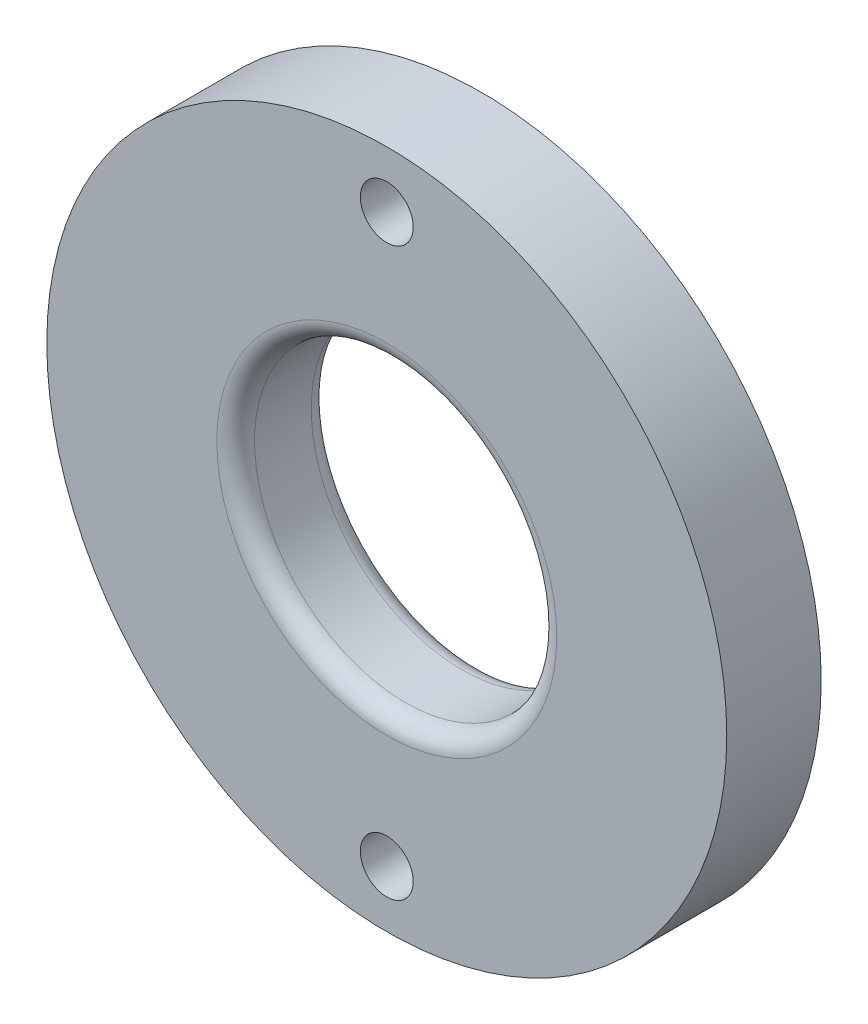
ISO-10303-21;
HEADER;
FILE_DESCRIPTION(('STEP AP214'),'2;1');
FILE_NAME('part.step','',(''),(''),'','','');
FILE_SCHEMA(('AUTOMOTIVE_DESIGN { 1 0 10303 214 1 1 1 1 }'));
ENDSEC;
DATA;
#1=APPLICATION_CONTEXT('core data for automotive mechanical design processes');
#2=APPLICATION_PROTOCOL_DEFINITION('international standard','automotive_design',2000,#1);
#3=PRODUCT_CONTEXT('',#1,'mechanical');
#4=PRODUCT('Part','Part','',(#3));
#5=PRODUCT_RELATED_PRODUCT_CATEGORY('part','',(#4));
#6=PRODUCT_DEFINITION_FORMATION('','',#4);
#7=PRODUCT_DEFINITION_CONTEXT('part definition',#1,'design');
#8=PRODUCT_DEFINITION('design','',#6,#7);
#9=PRODUCT_DEFINITION_SHAPE('','',#8);
#10=(LENGTH_UNIT() NAMED_UNIT(*) SI_UNIT(.MILLI.,.METRE.));
#11=(NAMED_UNIT(*) PLANE_ANGLE_UNIT() SI_UNIT($,.RADIAN.));
#12=(NAMED_UNIT(*) SI_UNIT($,.STERADIAN.) SOLID_ANGLE_UNIT());
#13=UNCERTAINTY_MEASURE_WITH_UNIT(LENGTH_MEASURE(1.E-05),#10,'distance_accuracy_value','');
#14=(GEOMETRIC_REPRESENTATION_CONTEXT(3) GLOBAL_UNCERTAINTY_ASSIGNED_CONTEXT((#13)) GLOBAL_UNIT_ASSIGNED_CONTEXT((#10,
#11,#12)) REPRESENTATION_CONTEXT('',''));
#15=CARTESIAN_POINT('',(0.,0.,0.));
#16=DIRECTION('',(0.,0.,1.));
#17=DIRECTION('',(1.,0.,0.));
#18=AXIS2_PLACEMENT_3D('',#15,#16,#17);
#19=CARTESIAN_POINT('',(0.,0.,3.175));
#20=DIRECTION('',(0.,0.,1.));
#21=DIRECTION('',(1.,0.,0.));
#22=AXIS2_PLACEMENT_3D('',#19,#20,#21);
#23=PLANE('',#22);
#24=CARTESIAN_POINT('',(0.,-9.525,3.175));
#25=DIRECTION('',(0.,0.,1.));
#26=DIRECTION('',(1.,0.,0.));
#27=AXIS2_PLACEMENT_3D('',#24,#25,#26);
#28=CIRCLE('',#27,0.889);
#29=CARTESIAN_POINT('',(0.889,-9.525,3.175));
#30=VERTEX_POINT('',#29);
#31=EDGE_CURVE('E68',#30,#30,#28,.T.);
#32=ORIENTED_EDGE('',*,*,#31,.F.);
#33=EDGE_LOOP('',(#32));
#34=FACE_BOUND('',#33,.T.);
#35=CARTESIAN_POINT('',(0.,9.525,3.175));
#36=DIRECTION('',(0.,0.,1.));
#37=DIRECTION('',(1.,0.,0.));
#38=AXIS2_PLACEMENT_3D('',#35,#36,#37);
#39=CIRCLE('',#38,0.889);
#40=CARTESIAN_POINT('',(0.889,9.525,3.175));
#41=VERTEX_POINT('',#40);
#42=EDGE_CURVE('E62',#41,#41,#39,.T.);
#43=ORIENTED_EDGE('',*,*,#42,.F.);
#44=EDGE_LOOP('',(#43));
#45=FACE_BOUND('',#44,.T.);
#46=CARTESIAN_POINT('',(0.,0.,3.175));
#47=DIRECTION('',(0.,0.,1.));
#48=DIRECTION('',(1.,0.,0.));
#49=AXIS2_PLACEMENT_3D('',#46,#47,#48);
#50=CIRCLE('',#49,5.715);
#51=CARTESIAN_POINT('',(5.715,0.,3.175));
#52=VERTEX_POINT('',#51);
#53=EDGE_CURVE('E10',#52,#52,#50,.F.);
#54=ORIENTED_EDGE('',*,*,#53,.T.);
#55=EDGE_LOOP('',(#54));
#56=FACE_BOUND('',#55,.T.);
#57=CARTESIAN_POINT('',(0.,0.,3.175));
#58=DIRECTION('',(0.,0.,1.));
#59=DIRECTION('',(1.,0.,0.));
#60=AXIS2_PLACEMENT_3D('',#57,#58,#59);
#61=CIRCLE('',#60,11.43);
#62=CARTESIAN_POINT('',(11.43,0.,3.175));
#63=VERTEX_POINT('',#62);
#64=EDGE_CURVE('E53',#63,#63,#61,.T.);
#65=ORIENTED_EDGE('',*,*,#64,.T.);
#66=EDGE_LOOP('',(#65));
#67=FACE_BOUND('',#66,.T.);
#68=ADVANCED_FACE('F33',(#34,#45,#56,#67),#23,.T.);
#69=CARTESIAN_POINT('',(0.,0.,0.));
#70=DIRECTION('',(0.,0.,1.));
#71=DIRECTION('',(1.,0.,0.));
#72=AXIS2_PLACEMENT_3D('',#69,#70,#71);
#73=PLANE('',#72);
#74=CARTESIAN_POINT('',(0.,-9.525,0.));
#75=DIRECTION('',(0.,0.,1.));
#76=DIRECTION('',(1.,0.,0.));
#77=AXIS2_PLACEMENT_3D('',#74,#75,#76);
#78=CIRCLE('',#77,0.888999999999999);
#79=CARTESIAN_POINT('',(0.888999999999999,-9.525,0.));
#80=VERTEX_POINT('',#79);
#81=EDGE_CURVE('E65',#80,#80,#78,.T.);
#82=ORIENTED_EDGE('',*,*,#81,.T.);
#83=EDGE_LOOP('',(#82));
#84=FACE_BOUND('',#83,.T.);
#85=CARTESIAN_POINT('',(0.,9.525,0.));
#86=DIRECTION('',(0.,0.,1.));
#87=DIRECTION('',(1.,0.,0.));
#88=AXIS2_PLACEMENT_3D('',#85,#86,#87);
#89=CIRCLE('',#88,0.888999999999999);
#90=CARTESIAN_POINT('',(0.888999999999999,9.525,0.));
#91=VERTEX_POINT('',#90);
#92=EDGE_CURVE('E57',#91,#91,#89,.T.);
#93=ORIENTED_EDGE('',*,*,#92,.T.);
#94=EDGE_LOOP('',(#93));
#95=FACE_BOUND('',#94,.T.);
#96=CARTESIAN_POINT('',(0.,0.,0.));
#97=DIRECTION('',(0.,0.,1.));
#98=DIRECTION('',(1.,0.,0.));
#99=AXIS2_PLACEMENT_3D('',#96,#97,#98);
#100=CIRCLE('',#99,5.715);
#101=CARTESIAN_POINT('',(5.715,0.,0.));
#102=VERTEX_POINT('',#101);
#103=EDGE_CURVE('E48',#102,#102,#100,.T.);
#104=ORIENTED_EDGE('',*,*,#103,.T.);
#105=EDGE_LOOP('',(#104));
#106=FACE_BOUND('',#105,.T.);
#107=CARTESIAN_POINT('',(0.,0.,0.));
#108=DIRECTION('',(0.,0.,1.));
#109=DIRECTION('',(1.,0.,0.));
#110=AXIS2_PLACEMENT_3D('',#107,#108,#109);
#111=CIRCLE('',#110,11.43);
#112=CARTESIAN_POINT('',(11.43,0.,0.));
#113=VERTEX_POINT('',#112);
#114=EDGE_CURVE('E54',#113,#113,#111,.T.);
#115=ORIENTED_EDGE('',*,*,#114,.F.);
#116=EDGE_LOOP('',(#115));
#117=FACE_BOUND('',#116,.T.);
#118=ADVANCED_FACE('F76',(#84,#95,#106,#117),#73,.F.);
#119=CARTESIAN_POINT('',(0.,0.,3.175));
#120=DIRECTION('',(0.,0.,-1.));
#121=DIRECTION('',(-1.,0.,0.));
#122=AXIS2_PLACEMENT_3D('',#119,#120,#121);
#123=CYLINDRICAL_SURFACE('',#122,11.43);
#124=ORIENTED_EDGE('',*,*,#64,.F.);
#125=EDGE_LOOP('',(#124));
#126=FACE_BOUND('',#125,.T.);
#127=ORIENTED_EDGE('',*,*,#114,.T.);
#128=EDGE_LOOP('',(#127));
#129=FACE_BOUND('',#128,.T.);
#130=ADVANCED_FACE('F82',(#126,#129),#123,.T.);
#131=CARTESIAN_POINT('',(0.,0.,3.175));
#132=DIRECTION('',(0.,0.,-1.));
#133=DIRECTION('',(-1.,0.,0.));
#134=AXIS2_PLACEMENT_3D('',#131,#132,#133);
#135=CYLINDRICAL_SURFACE('',#134,5.08);
#136=CARTESIAN_POINT('',(0.,0.,0.635));
#137=DIRECTION('',(0.,0.,1.));
#138=DIRECTION('',(1.,0.,0.));
#139=AXIS2_PLACEMENT_3D('',#136,#137,#138);
#140=CIRCLE('',#139,5.08);
#141=CARTESIAN_POINT('',(5.08,0.,0.635));
#142=VERTEX_POINT('',#141);
#143=EDGE_CURVE('E40',#142,#142,#140,.F.);
#144=ORIENTED_EDGE('',*,*,#143,.T.);
#145=EDGE_LOOP('',(#144));
#146=FACE_BOUND('',#145,.T.);
#147=CARTESIAN_POINT('',(0.,0.,2.54));
#148=DIRECTION('',(0.,0.,1.));
#149=DIRECTION('',(1.,0.,0.));
#150=AXIS2_PLACEMENT_3D('',#147,#148,#149);
#151=CIRCLE('',#150,5.08);
#152=CARTESIAN_POINT('',(5.08,0.,2.54));
#153=VERTEX_POINT('',#152);
#154=EDGE_CURVE('E44',#153,#153,#151,.T.);
#155=ORIENTED_EDGE('',*,*,#154,.T.);
#156=EDGE_LOOP('',(#155));
#157=FACE_BOUND('',#156,.T.);
#158=ADVANCED_FACE('F85',(#146,#157),#135,.F.);
#159=CARTESIAN_POINT('',(0.,0.,0.635));
#160=DIRECTION('',(0.,0.,1.));
#161=DIRECTION('',(1.,0.,0.));
#162=AXIS2_PLACEMENT_3D('',#159,#160,#161);
#163=TOROIDAL_SURFACE('',#162,5.715,0.635);
#164=ORIENTED_EDGE('',*,*,#143,.F.);
#165=EDGE_LOOP('',(#164));
#166=FACE_BOUND('',#165,.T.);
#167=ORIENTED_EDGE('',*,*,#103,.F.);
#168=EDGE_LOOP('',(#167));
#169=FACE_BOUND('',#168,.T.);
#170=ADVANCED_FACE('F96',(#166,#169),#163,.T.);
#171=CARTESIAN_POINT('',(0.,0.,2.54));
#172=DIRECTION('',(0.,0.,1.));
#173=DIRECTION('',(1.,0.,0.));
#174=AXIS2_PLACEMENT_3D('',#171,#172,#173);
#175=TOROIDAL_SURFACE('',#174,5.715,0.635);
#176=ORIENTED_EDGE('',*,*,#53,.F.);
#177=EDGE_LOOP('',(#176));
#178=FACE_BOUND('',#177,.T.);
#179=ORIENTED_EDGE('',*,*,#154,.F.);
#180=EDGE_LOOP('',(#179));
#181=FACE_BOUND('',#180,.T.);
#182=ADVANCED_FACE('F35',(#178,#181),#175,.T.);
#183=CARTESIAN_POINT('',(0.,9.525,3.175));
#184=DIRECTION('',(0.,0.,1.));
#185=DIRECTION('',(1.,0.,0.));
#186=AXIS2_PLACEMENT_3D('',#183,#184,#185);
#187=CYLINDRICAL_SURFACE('',#186,0.888999999999999);
#188=ORIENTED_EDGE('',*,*,#92,.F.);
#189=EDGE_LOOP('',(#188));
#190=FACE_BOUND('',#189,.T.);
#191=ORIENTED_EDGE('',*,*,#42,.T.);
#192=EDGE_LOOP('',(#191));
#193=FACE_BOUND('',#192,.T.);
#194=ADVANCED_FACE('F103',(#190,#193),#187,.F.);
#195=CARTESIAN_POINT('',(0.,-9.525,3.175));
#196=DIRECTION('',(0.,0.,1.));
#197=DIRECTION('',(1.,0.,0.));
#198=AXIS2_PLACEMENT_3D('',#195,#196,#197);
#199=CYLINDRICAL_SURFACE('',#198,0.888999999999999);
#200=ORIENTED_EDGE('',*,*,#81,.F.);
#201=EDGE_LOOP('',(#200));
#202=FACE_BOUND('',#201,.T.);
#203=ORIENTED_EDGE('',*,*,#31,.T.);
#204=EDGE_LOOP('',(#203));
#205=FACE_BOUND('',#204,.T.);
#206=ADVANCED_FACE('F72',(#202,#205),#199,.F.);
#207=CLOSED_SHELL('',(#68,#118,#130,#158,#170,#182,#194,#206));
#208=MANIFOLD_SOLID_BREP('B2',#207);
#209=ADVANCED_BREP_SHAPE_REPRESENTATION('',(#18,#208),#14);
#210=SHAPE_DEFINITION_REPRESENTATION(#9,#209);
ENDSEC;
END-ISO-10303-21;
